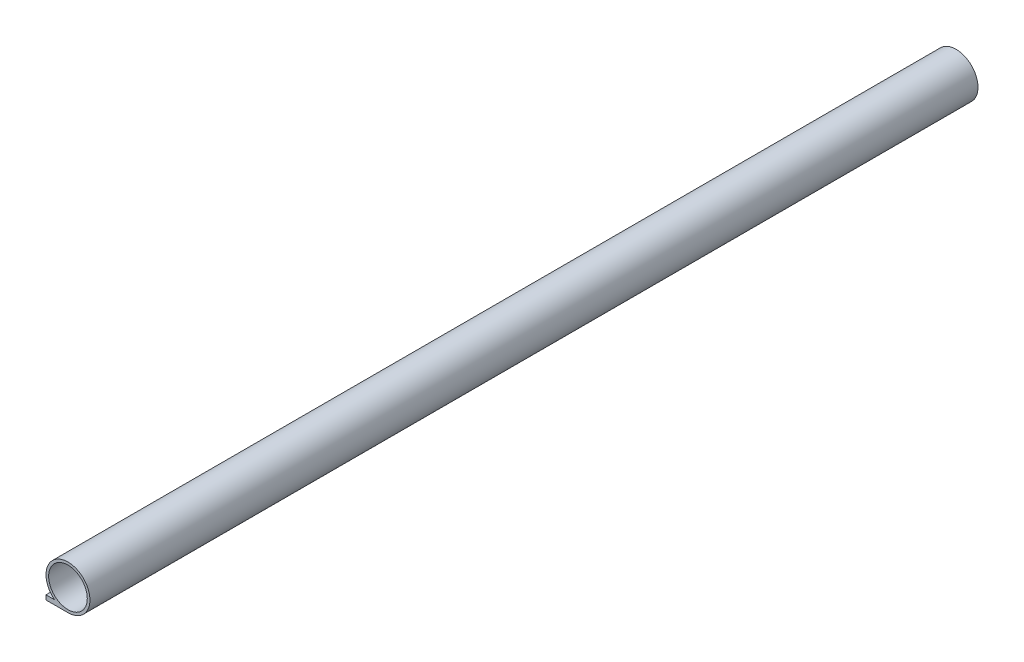
ISO-10303-21;
HEADER;
FILE_DESCRIPTION(('STEP AP214'),'2;1');
FILE_NAME('part.step','',(''),(''),'','','');
FILE_SCHEMA(('AUTOMOTIVE_DESIGN { 1 0 10303 214 1 1 1 1 }'));
ENDSEC;
DATA;
#1=APPLICATION_CONTEXT('core data for automotive mechanical design processes');
#2=APPLICATION_PROTOCOL_DEFINITION('international standard','automotive_design',2000,#1);
#3=PRODUCT_CONTEXT('',#1,'mechanical');
#4=PRODUCT('Part','Part','',(#3));
#5=PRODUCT_RELATED_PRODUCT_CATEGORY('part','',(#4));
#6=PRODUCT_DEFINITION_FORMATION('','',#4);
#7=PRODUCT_DEFINITION_CONTEXT('part definition',#1,'design');
#8=PRODUCT_DEFINITION('design','',#6,#7);
#9=PRODUCT_DEFINITION_SHAPE('','',#8);
#10=(LENGTH_UNIT() NAMED_UNIT(*) SI_UNIT(.MILLI.,.METRE.));
#11=(NAMED_UNIT(*) PLANE_ANGLE_UNIT() SI_UNIT($,.RADIAN.));
#12=(NAMED_UNIT(*) SI_UNIT($,.STERADIAN.) SOLID_ANGLE_UNIT());
#13=UNCERTAINTY_MEASURE_WITH_UNIT(LENGTH_MEASURE(1.E-05),#10,'distance_accuracy_value','');
#14=(GEOMETRIC_REPRESENTATION_CONTEXT(3) GLOBAL_UNCERTAINTY_ASSIGNED_CONTEXT((#13)) GLOBAL_UNIT_ASSIGNED_CONTEXT((#10,
#11,#12)) REPRESENTATION_CONTEXT('',''));
#15=CARTESIAN_POINT('',(0.,0.,0.));
#16=DIRECTION('',(0.,0.,1.));
#17=DIRECTION('',(1.,0.,0.));
#18=AXIS2_PLACEMENT_3D('',#15,#16,#17);
#19=CARTESIAN_POINT('',(0.,0.,513.588));
#20=DIRECTION('',(0.,0.,1.));
#21=DIRECTION('',(1.,0.,0.));
#22=AXIS2_PLACEMENT_3D('',#19,#20,#21);
#23=PLANE('',#22);
#24=CARTESIAN_POINT('',(0.,0.,513.588));
#25=DIRECTION('',(0.,0.,1.));
#26=DIRECTION('',(1.,0.,0.));
#27=AXIS2_PLACEMENT_3D('',#24,#25,#26);
#28=CIRCLE('',#27,12.7);
#29=CARTESIAN_POINT('',(0.,-12.7,513.588));
#30=VERTEX_POINT('',#29);
#31=CARTESIAN_POINT('',(-7.70393975508635,-10.0965,513.588));
#32=VERTEX_POINT('',#31);
#33=EDGE_CURVE('E158',#30,#32,#28,.T.);
#34=ORIENTED_EDGE('',*,*,#33,.T.);
#35=DIRECTION('',(-1.,0.,0.));
#36=VECTOR('',#35,1.);
#37=CARTESIAN_POINT('',(-12.7,-10.0965,513.588));
#38=LINE('',#37,#36);
#39=CARTESIAN_POINT('',(-12.7,-10.0965,513.588));
#40=VERTEX_POINT('',#39);
#41=EDGE_CURVE('E91',#32,#40,#38,.T.);
#42=ORIENTED_EDGE('',*,*,#41,.T.);
#43=DIRECTION('',(0.,-1.,0.));
#44=VECTOR('',#43,1.);
#45=CARTESIAN_POINT('',(-12.7,-12.7,513.588));
#46=LINE('',#45,#44);
#47=CARTESIAN_POINT('',(-12.7,-12.7,513.588));
#48=VERTEX_POINT('',#47);
#49=EDGE_CURVE('E161',#40,#48,#46,.T.);
#50=ORIENTED_EDGE('',*,*,#49,.T.);
#51=DIRECTION('',(1.,0.,0.));
#52=VECTOR('',#51,1.);
#53=CARTESIAN_POINT('',(0.,-12.7,513.588));
#54=LINE('',#53,#52);
#55=EDGE_CURVE('E63',#48,#30,#54,.T.);
#56=ORIENTED_EDGE('',*,*,#55,.T.);
#57=EDGE_LOOP('',(#34,#42,#50,#56));
#58=FACE_BOUND('',#57,.T.);
#59=CARTESIAN_POINT('',(0.,0.,513.588));
#60=DIRECTION('',(0.,0.,1.));
#61=DIRECTION('',(1.,0.,0.));
#62=AXIS2_PLACEMENT_3D('',#59,#60,#61);
#63=CIRCLE('',#62,11.176);
#64=CARTESIAN_POINT('',(11.176,0.,513.588));
#65=VERTEX_POINT('',#64);
#66=EDGE_CURVE('E152',#65,#65,#63,.T.);
#67=ORIENTED_EDGE('',*,*,#66,.F.);
#68=EDGE_LOOP('',(#67));
#69=FACE_BOUND('',#68,.T.);
#70=ADVANCED_FACE('F39',(#58,#69),#23,.T.);
#71=CARTESIAN_POINT('',(0.,0.,0.));
#72=DIRECTION('',(0.,0.,1.));
#73=DIRECTION('',(1.,0.,0.));
#74=AXIS2_PLACEMENT_3D('',#71,#72,#73);
#75=PLANE('',#74);
#76=CARTESIAN_POINT('',(0.,0.,0.));
#77=DIRECTION('',(0.,0.,1.));
#78=DIRECTION('',(1.,0.,0.));
#79=AXIS2_PLACEMENT_3D('',#76,#77,#78);
#80=CIRCLE('',#79,12.7);
#81=CARTESIAN_POINT('',(0.,-12.7,0.));
#82=VERTEX_POINT('',#81);
#83=CARTESIAN_POINT('',(-7.70393975508635,-10.0965,0.));
#84=VERTEX_POINT('',#83);
#85=EDGE_CURVE('E155',#82,#84,#80,.T.);
#86=ORIENTED_EDGE('',*,*,#85,.F.);
#87=DIRECTION('',(1.,0.,0.));
#88=VECTOR('',#87,1.);
#89=CARTESIAN_POINT('',(0.,-12.7,0.));
#90=LINE('',#89,#88);
#91=CARTESIAN_POINT('',(-12.7,-12.7,0.));
#92=VERTEX_POINT('',#91);
#93=EDGE_CURVE('E84',#92,#82,#90,.T.);
#94=ORIENTED_EDGE('',*,*,#93,.F.);
#95=DIRECTION('',(0.,-1.,0.));
#96=VECTOR('',#95,1.);
#97=CARTESIAN_POINT('',(-12.7,-12.7,0.));
#98=LINE('',#97,#96);
#99=CARTESIAN_POINT('',(-12.7,-10.0965,0.));
#100=VERTEX_POINT('',#99);
#101=EDGE_CURVE('E169',#100,#92,#98,.T.);
#102=ORIENTED_EDGE('',*,*,#101,.F.);
#103=DIRECTION('',(-1.,0.,0.));
#104=VECTOR('',#103,1.);
#105=CARTESIAN_POINT('',(-12.7,-10.0965,0.));
#106=LINE('',#105,#104);
#107=EDGE_CURVE('E167',#84,#100,#106,.T.);
#108=ORIENTED_EDGE('',*,*,#107,.F.);
#109=EDGE_LOOP('',(#86,#94,#102,#108));
#110=FACE_BOUND('',#109,.T.);
#111=CARTESIAN_POINT('',(0.,0.,0.));
#112=DIRECTION('',(0.,0.,1.));
#113=DIRECTION('',(1.,0.,0.));
#114=AXIS2_PLACEMENT_3D('',#111,#112,#113);
#115=CIRCLE('',#114,11.176);
#116=CARTESIAN_POINT('',(11.176,0.,0.));
#117=VERTEX_POINT('',#116);
#118=EDGE_CURVE('E148',#117,#117,#115,.T.);
#119=ORIENTED_EDGE('',*,*,#118,.T.);
#120=EDGE_LOOP('',(#119));
#121=FACE_BOUND('',#120,.T.);
#122=ADVANCED_FACE('F182',(#110,#121),#75,.F.);
#123=CARTESIAN_POINT('',(0.,0.,513.588));
#124=DIRECTION('',(0.,0.,-1.));
#125=DIRECTION('',(-1.,0.,0.));
#126=AXIS2_PLACEMENT_3D('',#123,#124,#125);
#127=CYLINDRICAL_SURFACE('',#126,12.7);
#128=ORIENTED_EDGE('',*,*,#85,.T.);
#129=DIRECTION('',(0.,0.,-1.));
#130=VECTOR('',#129,1.);
#131=CARTESIAN_POINT('',(-7.70393975508635,-10.0965,513.588));
#132=LINE('',#131,#130);
#133=EDGE_CURVE('E11',#32,#84,#132,.T.);
#134=ORIENTED_EDGE('',*,*,#133,.F.);
#135=ORIENTED_EDGE('',*,*,#33,.F.);
#136=DIRECTION('',(0.,0.,-1.));
#137=VECTOR('',#136,1.);
#138=CARTESIAN_POINT('',(0.,-12.7,513.588));
#139=LINE('',#138,#137);
#140=EDGE_CURVE('E164',#30,#82,#139,.T.);
#141=ORIENTED_EDGE('',*,*,#140,.T.);
#142=EDGE_LOOP('',(#128,#134,#135,#141));
#143=FACE_BOUND('',#142,.T.);
#144=ADVANCED_FACE('F41',(#143),#127,.T.);
#145=CARTESIAN_POINT('',(-12.7,-10.0965,513.588));
#146=DIRECTION('',(0.,-1.,0.));
#147=DIRECTION('',(0.,0.,-1.));
#148=AXIS2_PLACEMENT_3D('',#145,#146,#147);
#149=PLANE('',#148);
#150=ORIENTED_EDGE('',*,*,#107,.T.);
#151=DIRECTION('',(0.,0.,-1.));
#152=VECTOR('',#151,1.);
#153=CARTESIAN_POINT('',(-12.7,-10.0965,513.588));
#154=LINE('',#153,#152);
#155=EDGE_CURVE('E47',#40,#100,#154,.T.);
#156=ORIENTED_EDGE('',*,*,#155,.F.);
#157=ORIENTED_EDGE('',*,*,#41,.F.);
#158=ORIENTED_EDGE('',*,*,#133,.T.);
#159=EDGE_LOOP('',(#150,#156,#157,#158));
#160=FACE_BOUND('',#159,.T.);
#161=ADVANCED_FACE('F198',(#160),#149,.F.);
#162=CARTESIAN_POINT('',(-12.7,-12.7,513.588));
#163=DIRECTION('',(1.,0.,0.));
#164=DIRECTION('',(0.,0.,-1.));
#165=AXIS2_PLACEMENT_3D('',#162,#163,#164);
#166=PLANE('',#165);
#167=DIRECTION('',(0.,0.,1.));
#168=VECTOR('',#167,1.);
#169=CARTESIAN_POINT('',(-12.7,-12.192,1.27));
#170=LINE('',#169,#168);
#171=CARTESIAN_POINT('',(-12.7,-12.192,1.26999999999999));
#172=VERTEX_POINT('',#171);
#173=CARTESIAN_POINT('',(-12.7,-12.192,512.318));
#174=VERTEX_POINT('',#173);
#175=EDGE_CURVE('E142',#172,#174,#170,.T.);
#176=ORIENTED_EDGE('',*,*,#175,.F.);
#177=DIRECTION('',(0.,-1.,0.));
#178=VECTOR('',#177,1.);
#179=CARTESIAN_POINT('',(-12.7,-10.6045,1.27));
#180=LINE('',#179,#178);
#181=CARTESIAN_POINT('',(-12.7,-10.6045,1.27));
#182=VERTEX_POINT('',#181);
#183=EDGE_CURVE('E54',#182,#172,#180,.T.);
#184=ORIENTED_EDGE('',*,*,#183,.F.);
#185=DIRECTION('',(0.,0.,-1.));
#186=VECTOR('',#185,1.);
#187=CARTESIAN_POINT('',(-12.7,-10.6045,1.27));
#188=LINE('',#187,#186);
#189=CARTESIAN_POINT('',(-12.7,-10.6045,512.318));
#190=VERTEX_POINT('',#189);
#191=EDGE_CURVE('E133',#190,#182,#188,.T.);
#192=ORIENTED_EDGE('',*,*,#191,.F.);
#193=DIRECTION('',(0.,1.,0.));
#194=VECTOR('',#193,1.);
#195=CARTESIAN_POINT('',(-12.7,-10.6045,512.318));
#196=LINE('',#195,#194);
#197=EDGE_CURVE('E136',#174,#190,#196,.T.);
#198=ORIENTED_EDGE('',*,*,#197,.F.);
#199=EDGE_LOOP('',(#176,#184,#192,#198));
#200=FACE_BOUND('',#199,.T.);
#201=ORIENTED_EDGE('',*,*,#101,.T.);
#202=DIRECTION('',(0.,0.,-1.));
#203=VECTOR('',#202,1.);
#204=CARTESIAN_POINT('',(-12.7,-12.7,513.588));
#205=LINE('',#204,#203);
#206=EDGE_CURVE('E173',#48,#92,#205,.T.);
#207=ORIENTED_EDGE('',*,*,#206,.F.);
#208=ORIENTED_EDGE('',*,*,#49,.F.);
#209=ORIENTED_EDGE('',*,*,#155,.T.);
#210=EDGE_LOOP('',(#201,#207,#208,#209));
#211=FACE_BOUND('',#210,.T.);
#212=ADVANCED_FACE('F178',(#200,#211),#166,.F.);
#213=CARTESIAN_POINT('',(0.,-12.7,513.588));
#214=DIRECTION('',(0.,1.,0.));
#215=DIRECTION('',(-1.,0.,0.));
#216=AXIS2_PLACEMENT_3D('',#213,#214,#215);
#217=PLANE('',#216);
#218=ORIENTED_EDGE('',*,*,#93,.T.);
#219=ORIENTED_EDGE('',*,*,#140,.F.);
#220=ORIENTED_EDGE('',*,*,#55,.F.);
#221=ORIENTED_EDGE('',*,*,#206,.T.);
#222=EDGE_LOOP('',(#218,#219,#220,#221));
#223=FACE_BOUND('',#222,.T.);
#224=ADVANCED_FACE('F187',(#223),#217,.F.);
#225=CARTESIAN_POINT('',(0.,0.,513.588));
#226=DIRECTION('',(0.,0.,-1.));
#227=DIRECTION('',(-1.,0.,0.));
#228=AXIS2_PLACEMENT_3D('',#225,#226,#227);
#229=CYLINDRICAL_SURFACE('',#228,11.176);
#230=ORIENTED_EDGE('',*,*,#66,.T.);
#231=EDGE_LOOP('',(#230));
#232=FACE_BOUND('',#231,.T.);
#233=ORIENTED_EDGE('',*,*,#118,.F.);
#234=EDGE_LOOP('',(#233));
#235=FACE_BOUND('',#234,.T.);
#236=ADVANCED_FACE('F189',(#232,#235),#229,.F.);
#237=CARTESIAN_POINT('',(-7.62,-10.6045,1.27));
#238=DIRECTION('',(0.,0.,-1.));
#239=DIRECTION('',(-1.,0.,0.));
#240=AXIS2_PLACEMENT_3D('',#237,#238,#239);
#241=PLANE('',#240);
#242=ORIENTED_EDGE('',*,*,#183,.T.);
#243=DIRECTION('',(-1.,0.,0.));
#244=VECTOR('',#243,1.);
#245=CARTESIAN_POINT('',(-7.62,-12.192,1.27));
#246=LINE('',#245,#244);
#247=CARTESIAN_POINT('',(-7.62,-12.192,1.27));
#248=VERTEX_POINT('',#247);
#249=EDGE_CURVE('E111',#248,#172,#246,.T.);
#250=ORIENTED_EDGE('',*,*,#249,.F.);
#251=DIRECTION('',(0.,-1.,0.));
#252=VECTOR('',#251,1.);
#253=CARTESIAN_POINT('',(-7.62,-10.6045,1.27));
#254=LINE('',#253,#252);
#255=CARTESIAN_POINT('',(-7.62,-10.6045,1.27));
#256=VERTEX_POINT('',#255);
#257=EDGE_CURVE('E115',#256,#248,#254,.T.);
#258=ORIENTED_EDGE('',*,*,#257,.F.);
#259=DIRECTION('',(-1.,0.,0.));
#260=VECTOR('',#259,1.);
#261=CARTESIAN_POINT('',(-7.62,-10.6045,1.27));
#262=LINE('',#261,#260);
#263=EDGE_CURVE('E146',#256,#182,#262,.T.);
#264=ORIENTED_EDGE('',*,*,#263,.T.);
#265=EDGE_LOOP('',(#242,#250,#258,#264));
#266=FACE_BOUND('',#265,.T.);
#267=ADVANCED_FACE('F113',(#266),#241,.F.);
#268=CARTESIAN_POINT('',(-7.62,-10.6045,1.27));
#269=DIRECTION('',(0.,1.,0.));
#270=DIRECTION('',(0.,0.,1.));
#271=AXIS2_PLACEMENT_3D('',#268,#269,#270);
#272=PLANE('',#271);
#273=ORIENTED_EDGE('',*,*,#191,.T.);
#274=ORIENTED_EDGE('',*,*,#263,.F.);
#275=DIRECTION('',(0.,0.,-1.));
#276=VECTOR('',#275,1.);
#277=CARTESIAN_POINT('',(-7.62,-10.6045,1.27));
#278=LINE('',#277,#276);
#279=CARTESIAN_POINT('',(-7.62,-10.6045,512.318));
#280=VERTEX_POINT('',#279);
#281=EDGE_CURVE('E121',#280,#256,#278,.T.);
#282=ORIENTED_EDGE('',*,*,#281,.F.);
#283=DIRECTION('',(-1.,0.,0.));
#284=VECTOR('',#283,1.);
#285=CARTESIAN_POINT('',(-7.62,-10.6045,512.318));
#286=LINE('',#285,#284);
#287=EDGE_CURVE('E149',#280,#190,#286,.T.);
#288=ORIENTED_EDGE('',*,*,#287,.T.);
#289=EDGE_LOOP('',(#273,#274,#282,#288));
#290=FACE_BOUND('',#289,.T.);
#291=ADVANCED_FACE('F211',(#290),#272,.F.);
#292=CARTESIAN_POINT('',(-7.62,-10.6045,512.318));
#293=DIRECTION('',(0.,0.,1.));
#294=DIRECTION('',(1.,0.,0.));
#295=AXIS2_PLACEMENT_3D('',#292,#293,#294);
#296=PLANE('',#295);
#297=ORIENTED_EDGE('',*,*,#197,.T.);
#298=ORIENTED_EDGE('',*,*,#287,.F.);
#299=DIRECTION('',(0.,1.,0.));
#300=VECTOR('',#299,1.);
#301=CARTESIAN_POINT('',(-7.62,-10.6045,512.318));
#302=LINE('',#301,#300);
#303=CARTESIAN_POINT('',(-7.62,-12.192,512.318));
#304=VERTEX_POINT('',#303);
#305=EDGE_CURVE('E129',#304,#280,#302,.T.);
#306=ORIENTED_EDGE('',*,*,#305,.F.);
#307=DIRECTION('',(-1.,0.,0.));
#308=VECTOR('',#307,1.);
#309=CARTESIAN_POINT('',(-7.62,-12.192,512.318));
#310=LINE('',#309,#308);
#311=EDGE_CURVE('E120',#304,#174,#310,.T.);
#312=ORIENTED_EDGE('',*,*,#311,.T.);
#313=EDGE_LOOP('',(#297,#298,#306,#312));
#314=FACE_BOUND('',#313,.T.);
#315=ADVANCED_FACE('F214',(#314),#296,.F.);
#316=CARTESIAN_POINT('',(-7.62,-12.192,1.27));
#317=DIRECTION('',(0.,-1.,0.));
#318=DIRECTION('',(0.,0.,-1.));
#319=AXIS2_PLACEMENT_3D('',#316,#317,#318);
#320=PLANE('',#319);
#321=ORIENTED_EDGE('',*,*,#175,.T.);
#322=ORIENTED_EDGE('',*,*,#311,.F.);
#323=DIRECTION('',(0.,0.,1.));
#324=VECTOR('',#323,1.);
#325=CARTESIAN_POINT('',(-7.62,-12.192,1.27));
#326=LINE('',#325,#324);
#327=EDGE_CURVE('E124',#248,#304,#326,.T.);
#328=ORIENTED_EDGE('',*,*,#327,.F.);
#329=ORIENTED_EDGE('',*,*,#249,.T.);
#330=EDGE_LOOP('',(#321,#322,#328,#329));
#331=FACE_BOUND('',#330,.T.);
#332=ADVANCED_FACE('F125',(#331),#320,.F.);
#333=CARTESIAN_POINT('',(-7.62,0.,0.));
#334=DIRECTION('',(-1.,0.,0.));
#335=DIRECTION('',(0.,0.,1.));
#336=AXIS2_PLACEMENT_3D('',#333,#334,#335);
#337=PLANE('',#336);
#338=ORIENTED_EDGE('',*,*,#257,.T.);
#339=ORIENTED_EDGE('',*,*,#327,.T.);
#340=ORIENTED_EDGE('',*,*,#305,.T.);
#341=ORIENTED_EDGE('',*,*,#281,.T.);
#342=EDGE_LOOP('',(#338,#339,#340,#341));
#343=FACE_BOUND('',#342,.T.);
#344=ADVANCED_FACE('F131',(#343),#337,.T.);
#345=CLOSED_SHELL('',(#70,#122,#144,#161,#212,#224,#236,#267,#291,#315,#332,#344));
#346=MANIFOLD_SOLID_BREP('B2',#345);
#347=ADVANCED_BREP_SHAPE_REPRESENTATION('',(#18,#346),#14);
#348=SHAPE_DEFINITION_REPRESENTATION(#9,#347);
ENDSEC;
END-ISO-10303-21;
